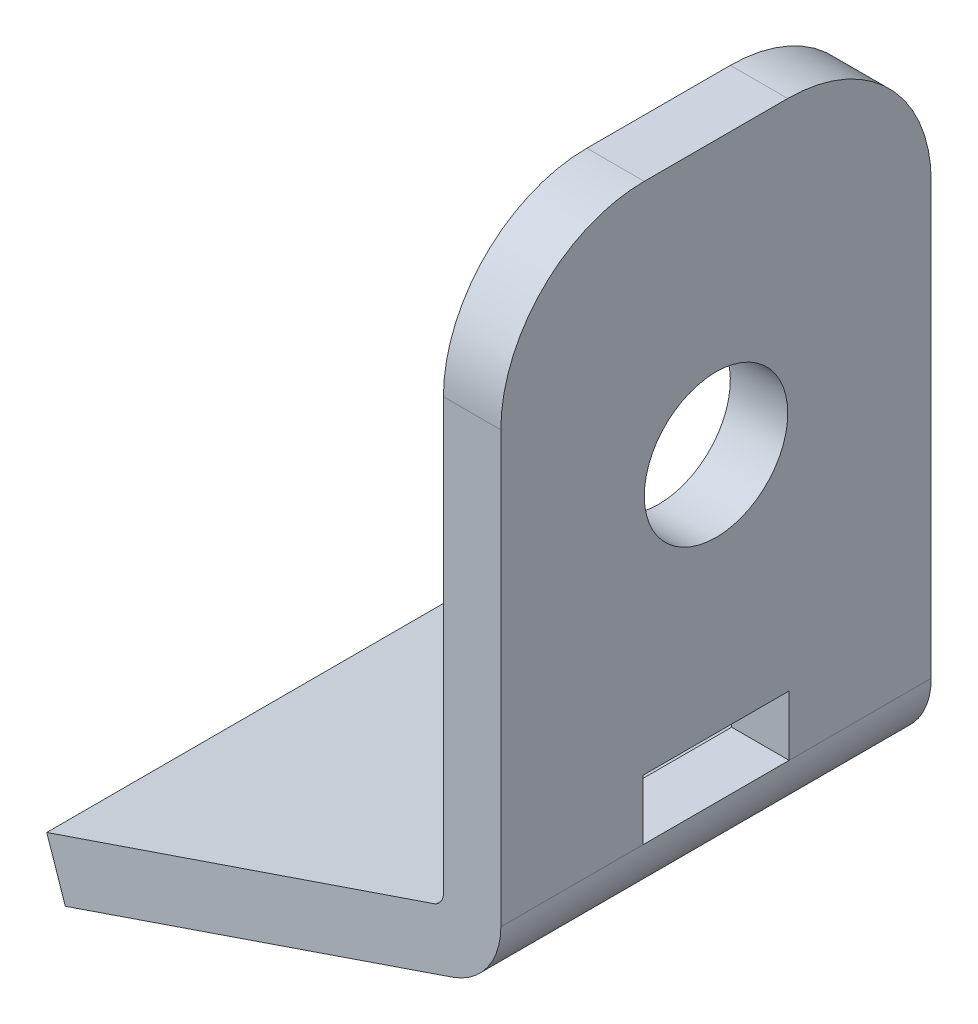
ISO-10303-21;
HEADER;
FILE_DESCRIPTION(('STEP AP214'),'2;1');
FILE_NAME('part.step','',(''),(''),'','','');
FILE_SCHEMA(('AUTOMOTIVE_DESIGN { 1 0 10303 214 1 1 1 1 }'));
ENDSEC;
DATA;
#1=APPLICATION_CONTEXT('core data for automotive mechanical design processes');
#2=APPLICATION_PROTOCOL_DEFINITION('international standard','automotive_design',2000,#1);
#3=PRODUCT_CONTEXT('',#1,'mechanical');
#4=PRODUCT('Part','Part','',(#3));
#5=PRODUCT_RELATED_PRODUCT_CATEGORY('part','',(#4));
#6=PRODUCT_DEFINITION_FORMATION('','',#4);
#7=PRODUCT_DEFINITION_CONTEXT('part definition',#1,'design');
#8=PRODUCT_DEFINITION('design','',#6,#7);
#9=PRODUCT_DEFINITION_SHAPE('','',#8);
#10=(LENGTH_UNIT() NAMED_UNIT(*) SI_UNIT(.MILLI.,.METRE.));
#11=(NAMED_UNIT(*) PLANE_ANGLE_UNIT() SI_UNIT($,.RADIAN.));
#12=(NAMED_UNIT(*) SI_UNIT($,.STERADIAN.) SOLID_ANGLE_UNIT());
#13=UNCERTAINTY_MEASURE_WITH_UNIT(LENGTH_MEASURE(1.E-05),#10,'distance_accuracy_value','');
#14=(GEOMETRIC_REPRESENTATION_CONTEXT(3) GLOBAL_UNCERTAINTY_ASSIGNED_CONTEXT((#13)) GLOBAL_UNIT_ASSIGNED_CONTEXT((#10,
#11,#12)) REPRESENTATION_CONTEXT('',''));
#15=CARTESIAN_POINT('',(0.,0.,0.));
#16=DIRECTION('',(0.,0.,1.));
#17=DIRECTION('',(1.,0.,0.));
#18=AXIS2_PLACEMENT_3D('',#15,#16,#17);
#19=CARTESIAN_POINT('',(-9.99999999999997,-375.320100819107,15.));
#20=DIRECTION('',(1.,0.,0.));
#21=DIRECTION('',(0.,1.,0.));
#22=AXIS2_PLACEMENT_3D('',#19,#20,#21);
#23=PLANE('',#22);
#24=CARTESIAN_POINT('',(-9.99999999999997,-364.820100819107,7.5));
#25=DIRECTION('',(1.,0.,0.));
#26=DIRECTION('',(0.,-1.,0.));
#27=AXIS2_PLACEMENT_3D('',#24,#25,#26);
#28=CIRCLE('',#27,2.5);
#29=CARTESIAN_POINT('',(-9.99999999999997,-367.320100819107,7.5));
#30=VERTEX_POINT('',#29);
#31=EDGE_CURVE('E177',#30,#30,#28,.T.);
#32=ORIENTED_EDGE('',*,*,#31,.T.);
#33=EDGE_LOOP('',(#32));
#34=FACE_BOUND('',#33,.T.);
#35=DIRECTION('',(0.,1.,0.));
#36=VECTOR('',#35,1.);
#37=CARTESIAN_POINT('',(-9.99999999999997,-375.320100819107,0.));
#38=LINE('',#37,#36);
#39=CARTESIAN_POINT('',(-9.99999999999997,-375.320100819107,0.));
#40=VERTEX_POINT('',#39);
#41=CARTESIAN_POINT('',(-9.99999999999997,-360.320100819107,0.));
#42=VERTEX_POINT('',#41);
#43=EDGE_CURVE('E208',#40,#42,#38,.T.);
#44=ORIENTED_EDGE('',*,*,#43,.F.);
#45=DIRECTION('',(0.,0.,-1.));
#46=VECTOR('',#45,1.);
#47=CARTESIAN_POINT('',(-9.99999999999997,-375.320100819107,15.));
#48=LINE('',#47,#46);
#49=CARTESIAN_POINT('',(-9.99999999999997,-375.320100819107,4.95279767505963));
#50=VERTEX_POINT('',#49);
#51=EDGE_CURVE('E162',#50,#40,#48,.T.);
#52=ORIENTED_EDGE('',*,*,#51,.F.);
#53=DIRECTION('',(0.,1.,0.));
#54=VECTOR('',#53,1.);
#55=CARTESIAN_POINT('',(-9.99999999999997,-375.320100819107,4.95279767505963));
#56=LINE('',#55,#54);
#57=CARTESIAN_POINT('',(-9.99999999999997,-373.22351081855,4.95279767505963));
#58=VERTEX_POINT('',#57);
#59=EDGE_CURVE('E142',#50,#58,#56,.T.);
#60=ORIENTED_EDGE('',*,*,#59,.T.);
#61=DIRECTION('',(0.,0.,-1.));
#62=VECTOR('',#61,1.);
#63=CARTESIAN_POINT('',(-9.99999999999997,-373.22351081855,10.0482237433539));
#64=LINE('',#63,#62);
#65=CARTESIAN_POINT('',(-9.99999999999997,-373.22351081855,10.0482237433539));
#66=VERTEX_POINT('',#65);
#67=EDGE_CURVE('E153',#66,#58,#64,.T.);
#68=ORIENTED_EDGE('',*,*,#67,.F.);
#69=DIRECTION('',(0.,1.,0.));
#70=VECTOR('',#69,1.);
#71=CARTESIAN_POINT('',(-9.99999999999997,-375.320100819107,10.0482237433539));
#72=LINE('',#71,#70);
#73=CARTESIAN_POINT('',(-9.99999999999997,-375.320100819107,10.0482237433539));
#74=VERTEX_POINT('',#73);
#75=EDGE_CURVE('E158',#74,#66,#72,.T.);
#76=ORIENTED_EDGE('',*,*,#75,.F.);
#77=CARTESIAN_POINT('',(-9.99999999999997,-375.320100819107,15.));
#78=VERTEX_POINT('',#77);
#79=EDGE_CURVE('E228',#78,#74,#48,.T.);
#80=ORIENTED_EDGE('',*,*,#79,.F.);
#81=DIRECTION('',(0.,1.,0.));
#82=VECTOR('',#81,1.);
#83=CARTESIAN_POINT('',(-9.99999999999997,-375.320100819107,15.));
#84=LINE('',#83,#82);
#85=CARTESIAN_POINT('',(-9.99999999999997,-360.320100819107,15.));
#86=VERTEX_POINT('',#85);
#87=EDGE_CURVE('E191',#78,#86,#84,.T.);
#88=ORIENTED_EDGE('',*,*,#87,.T.);
#89=CARTESIAN_POINT('',(-9.99999999999997,-360.320100819107,10.));
#90=DIRECTION('',(-1.,0.,0.));
#91=DIRECTION('',(0.,1.,0.));
#92=AXIS2_PLACEMENT_3D('',#89,#90,#91);
#93=CIRCLE('',#92,5.);
#94=CARTESIAN_POINT('',(-9.99999999999997,-355.320100819107,10.));
#95=VERTEX_POINT('',#94);
#96=EDGE_CURVE('E246',#95,#86,#93,.F.);
#97=ORIENTED_EDGE('',*,*,#96,.F.);
#98=DIRECTION('',(0.,0.,-1.));
#99=VECTOR('',#98,1.);
#100=CARTESIAN_POINT('',(-9.99999999999997,-355.320100819107,15.));
#101=LINE('',#100,#99);
#102=CARTESIAN_POINT('',(-9.99999999999997,-355.320100819107,5.));
#103=VERTEX_POINT('',#102);
#104=EDGE_CURVE('E225',#95,#103,#101,.T.);
#105=ORIENTED_EDGE('',*,*,#104,.T.);
#106=CARTESIAN_POINT('',(-9.99999999999997,-360.320100819107,5.));
#107=DIRECTION('',(-1.,0.,0.));
#108=DIRECTION('',(0.,1.,0.));
#109=AXIS2_PLACEMENT_3D('',#106,#107,#108);
#110=CIRCLE('',#109,5.);
#111=EDGE_CURVE('E248',#42,#103,#110,.F.);
#112=ORIENTED_EDGE('',*,*,#111,.F.);
#113=EDGE_LOOP('',(#44,#52,#60,#68,#76,#80,#88,#97,#105,#112));
#114=FACE_BOUND('',#113,.T.);
#115=ADVANCED_FACE('F37',(#34,#114),#23,.F.);
#116=CARTESIAN_POINT('',(-7.99778991779578,-375.320100819107,15.));
#117=DIRECTION('',(0.999999993894421,0.000110504109535088,0.));
#118=DIRECTION('',(-0.000110504109535088,0.999999993894421,0.));
#119=AXIS2_PLACEMENT_3D('',#116,#117,#118);
#120=PLANE('',#119);
#121=CARTESIAN_POINT('',(-7.99895021095298,-364.820100819107,7.5));
#122=DIRECTION('',(-0.999999993894421,-0.000110504109535088,0.));
#123=DIRECTION('',(-0.000110504109535088,0.999999993894421,0.));
#124=AXIS2_PLACEMENT_3D('',#121,#122,#123);
#125=ELLIPSE('',#124,2.50000001526395,2.5);
#126=CARTESIAN_POINT('',(-7.9992264712285,-362.320100819107,7.5));
#127=VERTEX_POINT('',#126);
#128=EDGE_CURVE('E180',#127,#127,#125,.T.);
#129=ORIENTED_EDGE('',*,*,#128,.T.);
#130=EDGE_LOOP('',(#129));
#131=FACE_BOUND('',#130,.T.);
#132=DIRECTION('',(0.,0.,-1.));
#133=VECTOR('',#132,1.);
#134=CARTESIAN_POINT('',(-7.99999999999997,-355.320100819107,15.));
#135=LINE('',#134,#133);
#136=CARTESIAN_POINT('',(-7.99999999999997,-355.320100819107,10.));
#137=VERTEX_POINT('',#136);
#138=CARTESIAN_POINT('',(-7.99999999999997,-355.320100819107,5.));
#139=VERTEX_POINT('',#138);
#140=EDGE_CURVE('E221',#137,#139,#135,.T.);
#141=ORIENTED_EDGE('',*,*,#140,.F.);
#142=CARTESIAN_POINT('',(-7.99944747944892,-360.320100819107,10.));
#143=DIRECTION('',(-0.999999993894421,-0.000110504109535088,0.));
#144=DIRECTION('',(0.000110504109535088,-0.999999993894421,0.));
#145=AXIS2_PLACEMENT_3D('',#142,#143,#144);
#146=ELLIPSE('',#145,5.0000000305279,5.);
#147=CARTESIAN_POINT('',(-7.99944747944892,-360.320100819107,15.));
#148=VERTEX_POINT('',#147);
#149=EDGE_CURVE('E253',#148,#137,#146,.T.);
#150=ORIENTED_EDGE('',*,*,#149,.F.);
#151=DIRECTION('',(-0.000110504109535088,0.999999993894421,0.));
#152=VECTOR('',#151,1.);
#153=CARTESIAN_POINT('',(-7.99778991779578,-375.320100819107,15.));
#154=LINE('',#153,#152);
#155=CARTESIAN_POINT('',(-7.9977899177958,-375.320100819107,15.));
#156=VERTEX_POINT('',#155);
#157=EDGE_CURVE('E194',#156,#148,#154,.T.);
#158=ORIENTED_EDGE('',*,*,#157,.F.);
#159=DIRECTION('',(0.,0.,-1.));
#160=VECTOR('',#159,1.);
#161=CARTESIAN_POINT('',(-7.9977899177958,-375.320100819107,15.));
#162=LINE('',#161,#160);
#163=CARTESIAN_POINT('',(-7.9977899177958,-375.320100819107,10.0482237433539));
#164=VERTEX_POINT('',#163);
#165=EDGE_CURVE('E218',#156,#164,#162,.T.);
#166=ORIENTED_EDGE('',*,*,#165,.T.);
#167=DIRECTION('',(0.000110504109535088,-0.999999993894421,0.));
#168=VECTOR('',#167,1.);
#169=CARTESIAN_POINT('',(-7.99778991779578,-375.320100819107,10.0482237433539));
#170=LINE('',#169,#168);
#171=CARTESIAN_POINT('',(-7.99802159960826,-373.22351081855,10.0482237433539));
#172=VERTEX_POINT('',#171);
#173=EDGE_CURVE('E174',#172,#164,#170,.T.);
#174=ORIENTED_EDGE('',*,*,#173,.F.);
#175=DIRECTION('',(0.,0.,1.));
#176=VECTOR('',#175,1.);
#177=CARTESIAN_POINT('',(-7.99802159960826,-373.22351081855,15.));
#178=LINE('',#177,#176);
#179=CARTESIAN_POINT('',(-7.99802159960826,-373.22351081855,4.95279767505963));
#180=VERTEX_POINT('',#179);
#181=EDGE_CURVE('E240',#180,#172,#178,.T.);
#182=ORIENTED_EDGE('',*,*,#181,.F.);
#183=DIRECTION('',(0.000110504109535088,-0.999999993894421,0.));
#184=VECTOR('',#183,1.);
#185=CARTESIAN_POINT('',(-7.99778991779578,-375.320100819107,4.95279767505963));
#186=LINE('',#185,#184);
#187=CARTESIAN_POINT('',(-7.9977899177958,-375.320100819107,4.95279767505963));
#188=VERTEX_POINT('',#187);
#189=EDGE_CURVE('E145',#180,#188,#186,.T.);
#190=ORIENTED_EDGE('',*,*,#189,.T.);
#191=CARTESIAN_POINT('',(-7.9977899177958,-375.320100819107,0.));
#192=VERTEX_POINT('',#191);
#193=EDGE_CURVE('E217',#188,#192,#162,.T.);
#194=ORIENTED_EDGE('',*,*,#193,.T.);
#195=DIRECTION('',(-0.000110504109535088,0.999999993894421,0.));
#196=VECTOR('',#195,1.);
#197=CARTESIAN_POINT('',(-7.99778991779578,-375.320100819107,0.));
#198=LINE('',#197,#196);
#199=CARTESIAN_POINT('',(-7.99944747944892,-360.320100819107,0.));
#200=VERTEX_POINT('',#199);
#201=EDGE_CURVE('E211',#192,#200,#198,.T.);
#202=ORIENTED_EDGE('',*,*,#201,.T.);
#203=CARTESIAN_POINT('',(-7.99944747944892,-360.320100819107,5.));
#204=DIRECTION('',(-0.999999993894421,-0.000110504109535088,0.));
#205=DIRECTION('',(-0.000110504109535088,0.999999993894421,0.));
#206=AXIS2_PLACEMENT_3D('',#203,#204,#205);
#207=ELLIPSE('',#206,5.0000000305279,5.);
#208=EDGE_CURVE('E45',#139,#200,#207,.T.);
#209=ORIENTED_EDGE('',*,*,#208,.F.);
#210=EDGE_LOOP('',(#141,#150,#158,#166,#174,#182,#190,#194,#202,#209));
#211=FACE_BOUND('',#210,.T.);
#212=ADVANCED_FACE('F260',(#131,#211),#120,.T.);
#213=CARTESIAN_POINT('',(-9.64273955948167,-377.669332371071,15.));
#214=DIRECTION('',(-0.323043540097111,0.946384103417596,0.));
#215=DIRECTION('',(-0.946384103417596,-0.323043540097111,0.));
#216=AXIS2_PLACEMENT_3D('',#213,#214,#215);
#217=PLANE('',#216);
#218=DIRECTION('',(-0.946384103417596,-0.323043540097111,0.));
#219=VECTOR('',#218,1.);
#220=CARTESIAN_POINT('',(-9.64273955948167,-377.669332371071,0.));
#221=LINE('',#220,#219);
#222=CARTESIAN_POINT('',(-9.64273955948167,-377.669332371071,0.));
#223=VERTEX_POINT('',#222);
#224=CARTESIAN_POINT('',(-23.1754299757358,-382.28864941509,0.));
#225=VERTEX_POINT('',#224);
#226=EDGE_CURVE('E199',#223,#225,#221,.T.);
#227=ORIENTED_EDGE('',*,*,#226,.F.);
#228=DIRECTION('',(0.,0.,-1.));
#229=VECTOR('',#228,1.);
#230=CARTESIAN_POINT('',(-9.64273955948167,-377.669332371071,15.));
#231=LINE('',#230,#229);
#232=CARTESIAN_POINT('',(-9.64273955948167,-377.669332371071,15.));
#233=VERTEX_POINT('',#232);
#234=EDGE_CURVE('E198',#233,#223,#231,.T.);
#235=ORIENTED_EDGE('',*,*,#234,.F.);
#236=DIRECTION('',(-0.946384103417596,-0.323043540097111,0.));
#237=VECTOR('',#236,1.);
#238=CARTESIAN_POINT('',(-9.64273955948167,-377.669332371071,15.));
#239=LINE('',#238,#237);
#240=CARTESIAN_POINT('',(-23.1754299757358,-382.28864941509,15.));
#241=VERTEX_POINT('',#240);
#242=EDGE_CURVE('E181',#233,#241,#239,.T.);
#243=ORIENTED_EDGE('',*,*,#242,.T.);
#244=DIRECTION('',(0.,0.,-1.));
#245=VECTOR('',#244,1.);
#246=CARTESIAN_POINT('',(-23.1754299757358,-382.28864941509,15.));
#247=LINE('',#246,#245);
#248=EDGE_CURVE('E237',#241,#225,#247,.T.);
#249=ORIENTED_EDGE('',*,*,#248,.T.);
#250=EDGE_LOOP('',(#227,#235,#243,#249));
#251=FACE_BOUND('',#250,.T.);
#252=ADVANCED_FACE('F302',(#251),#217,.F.);
#253=CARTESIAN_POINT('',(-23.8241382022311,-380.384479307007,15.));
#254=DIRECTION('',(-0.946577072562311,-0.322477666977677,0.));
#255=DIRECTION('',(0.322477666977677,-0.946577072562311,0.));
#256=AXIS2_PLACEMENT_3D('',#253,#254,#255);
#257=PLANE('',#256);
#258=DIRECTION('',(0.322477666977677,-0.946577072562311,0.));
#259=VECTOR('',#258,1.);
#260=CARTESIAN_POINT('',(-23.8241382022311,-380.384479307007,0.));
#261=LINE('',#260,#259);
#262=CARTESIAN_POINT('',(-23.8241382022311,-380.384479307007,0.));
#263=VERTEX_POINT('',#262);
#264=EDGE_CURVE('E202',#263,#225,#261,.T.);
#265=ORIENTED_EDGE('',*,*,#264,.T.);
#266=ORIENTED_EDGE('',*,*,#248,.F.);
#267=DIRECTION('',(0.322477666977677,-0.946577072562311,0.));
#268=VECTOR('',#267,1.);
#269=CARTESIAN_POINT('',(-23.8241382022311,-380.384479307007,15.));
#270=LINE('',#269,#268);
#271=CARTESIAN_POINT('',(-23.8241382022311,-380.384479307007,15.));
#272=VERTEX_POINT('',#271);
#273=EDGE_CURVE('E184',#272,#241,#270,.T.);
#274=ORIENTED_EDGE('',*,*,#273,.F.);
#275=DIRECTION('',(0.,0.,-1.));
#276=VECTOR('',#275,1.);
#277=CARTESIAN_POINT('',(-23.8241382022311,-380.384479307007,15.));
#278=LINE('',#277,#276);
#279=EDGE_CURVE('E234',#272,#263,#278,.T.);
#280=ORIENTED_EDGE('',*,*,#279,.T.);
#281=EDGE_LOOP('',(#265,#266,#274,#280));
#282=FACE_BOUND('',#281,.T.);
#283=ADVANCED_FACE('F298',(#282),#257,.T.);
#284=CARTESIAN_POINT('',(-10.2886908691296,-375.773254712625,15.));
#285=DIRECTION('',(-0.322477666977678,0.94657707256231,0.));
#286=DIRECTION('',(-0.946577072562311,-0.322477666977678,0.));
#287=AXIS2_PLACEMENT_3D('',#284,#285,#286);
#288=PLANE('',#287);
#289=DIRECTION('',(-0.94657707256231,-0.322477666977678,0.));
#290=VECTOR('',#289,1.);
#291=CARTESIAN_POINT('',(-10.2886908691296,-375.773254712625,0.));
#292=LINE('',#291,#290);
#293=CARTESIAN_POINT('',(-10.2886908691296,-375.773254712625,0.));
#294=VERTEX_POINT('',#293);
#295=EDGE_CURVE('E204',#294,#263,#292,.T.);
#296=ORIENTED_EDGE('',*,*,#295,.T.);
#297=ORIENTED_EDGE('',*,*,#279,.F.);
#298=DIRECTION('',(-0.946577072562312,-0.322477666977673,0.));
#299=VECTOR('',#298,1.);
#300=CARTESIAN_POINT('',(-21.4549551044454,-379.577351540909,15.));
#301=LINE('',#300,#299);
#302=CARTESIAN_POINT('',(-10.2886908691296,-375.773254712625,15.));
#303=VERTEX_POINT('',#302);
#304=EDGE_CURVE('E187',#303,#272,#301,.T.);
#305=ORIENTED_EDGE('',*,*,#304,.F.);
#306=DIRECTION('',(0.,0.,-1.));
#307=VECTOR('',#306,1.);
#308=CARTESIAN_POINT('',(-10.2886908691296,-375.773254712625,15.));
#309=LINE('',#308,#307);
#310=EDGE_CURVE('E231',#303,#294,#309,.T.);
#311=ORIENTED_EDGE('',*,*,#310,.T.);
#312=EDGE_LOOP('',(#296,#297,#305,#311));
#313=FACE_BOUND('',#312,.T.);
#314=ADVANCED_FACE('F294',(#313),#288,.T.);
#315=CARTESIAN_POINT('',(-10.5,-375.320100819107,15.));
#316=DIRECTION('',(0.,0.,-1.));
#317=DIRECTION('',(1.,0.,0.));
#318=AXIS2_PLACEMENT_3D('',#315,#316,#317);
#319=CYLINDRICAL_SURFACE('',#318,0.500000000000024);
#320=CARTESIAN_POINT('',(-10.5,-375.320100819107,0.));
#321=DIRECTION('',(0.,0.,1.));
#322=DIRECTION('',(1.,0.,0.));
#323=AXIS2_PLACEMENT_3D('',#320,#321,#322);
#324=CIRCLE('',#323,0.500000000000024);
#325=EDGE_CURVE('E206',#294,#40,#324,.T.);
#326=ORIENTED_EDGE('',*,*,#325,.F.);
#327=ORIENTED_EDGE('',*,*,#310,.F.);
#328=CARTESIAN_POINT('',(-10.5,-375.320100819107,15.));
#329=DIRECTION('',(0.,0.,1.));
#330=DIRECTION('',(1.,0.,0.));
#331=AXIS2_PLACEMENT_3D('',#328,#329,#330);
#332=CIRCLE('',#331,0.500000000000024);
#333=EDGE_CURVE('E189',#303,#78,#332,.T.);
#334=ORIENTED_EDGE('',*,*,#333,.T.);
#335=ORIENTED_EDGE('',*,*,#79,.T.);
#336=DIRECTION('',(0.,0.,-1.));
#337=VECTOR('',#336,1.);
#338=CARTESIAN_POINT('',(-9.99999999999997,-375.320100819107,10.0482237433539));
#339=LINE('',#338,#337);
#340=EDGE_CURVE('E163',#74,#50,#339,.T.);
#341=ORIENTED_EDGE('',*,*,#340,.T.);
#342=ORIENTED_EDGE('',*,*,#51,.T.);
#343=EDGE_LOOP('',(#326,#327,#334,#335,#341,#342));
#344=FACE_BOUND('',#343,.T.);
#345=ADVANCED_FACE('F290',(#344),#319,.F.);
#346=CARTESIAN_POINT('',(-7.99999999999997,-355.320100819107,15.));
#347=DIRECTION('',(0.,1.,0.));
#348=DIRECTION('',(0.,0.,-1.));
#349=AXIS2_PLACEMENT_3D('',#346,#347,#348);
#350=PLANE('',#349);
#351=ORIENTED_EDGE('',*,*,#104,.F.);
#352=DIRECTION('',(-1.,0.,0.));
#353=VECTOR('',#352,1.);
#354=CARTESIAN_POINT('',(-9.99999999999997,-355.320100819107,10.));
#355=LINE('',#354,#353);
#356=EDGE_CURVE('E250',#137,#95,#355,.T.);
#357=ORIENTED_EDGE('',*,*,#356,.F.);
#358=ORIENTED_EDGE('',*,*,#140,.T.);
#359=DIRECTION('',(-1.,0.,0.));
#360=VECTOR('',#359,1.);
#361=CARTESIAN_POINT('',(-7.99999999999997,-355.320100819107,5.));
#362=LINE('',#361,#360);
#363=EDGE_CURVE('E58',#103,#139,#362,.F.);
#364=ORIENTED_EDGE('',*,*,#363,.F.);
#365=EDGE_LOOP('',(#351,#357,#358,#364));
#366=FACE_BOUND('',#365,.T.);
#367=ADVANCED_FACE('F268',(#366),#350,.T.);
#368=CARTESIAN_POINT('',(-10.4977899177958,-375.320100819107,15.));
#369=DIRECTION('',(0.,0.,-1.));
#370=DIRECTION('',(1.,0.,0.));
#371=AXIS2_PLACEMENT_3D('',#368,#369,#370);
#372=CYLINDRICAL_SURFACE('',#371,2.50000000000001);
#373=CARTESIAN_POINT('',(-10.4977899177958,-375.320100819107,0.));
#374=DIRECTION('',(0.,0.,1.));
#375=DIRECTION('',(1.,0.,0.));
#376=AXIS2_PLACEMENT_3D('',#373,#374,#375);
#377=CIRCLE('',#376,2.50000000000001);
#378=EDGE_CURVE('E185',#223,#192,#377,.T.);
#379=ORIENTED_EDGE('',*,*,#378,.T.);
#380=ORIENTED_EDGE('',*,*,#193,.F.);
#381=EDGE_CURVE('E222',#164,#188,#162,.T.);
#382=ORIENTED_EDGE('',*,*,#381,.F.);
#383=ORIENTED_EDGE('',*,*,#165,.F.);
#384=CARTESIAN_POINT('',(-10.4977899177958,-375.320100819107,15.));
#385=DIRECTION('',(0.,0.,1.));
#386=DIRECTION('',(1.,0.,0.));
#387=AXIS2_PLACEMENT_3D('',#384,#385,#386);
#388=CIRCLE('',#387,2.50000000000001);
#389=EDGE_CURVE('E196',#233,#156,#388,.T.);
#390=ORIENTED_EDGE('',*,*,#389,.F.);
#391=ORIENTED_EDGE('',*,*,#234,.T.);
#392=EDGE_LOOP('',(#379,#380,#382,#383,#390,#391));
#393=FACE_BOUND('',#392,.T.);
#394=ADVANCED_FACE('F281',(#393),#372,.T.);
#395=CARTESIAN_POINT('',(-10.5,-375.320100819107,15.));
#396=DIRECTION('',(0.,0.,-1.));
#397=DIRECTION('',(1.,0.,0.));
#398=AXIS2_PLACEMENT_3D('',#395,#396,#397);
#399=PLANE('',#398);
#400=ORIENTED_EDGE('',*,*,#87,.F.);
#401=ORIENTED_EDGE('',*,*,#333,.F.);
#402=ORIENTED_EDGE('',*,*,#304,.T.);
#403=ORIENTED_EDGE('',*,*,#273,.T.);
#404=ORIENTED_EDGE('',*,*,#242,.F.);
#405=ORIENTED_EDGE('',*,*,#389,.T.);
#406=ORIENTED_EDGE('',*,*,#157,.T.);
#407=DIRECTION('',(-1.,0.,0.));
#408=VECTOR('',#407,1.);
#409=CARTESIAN_POINT('',(-7.99999999999997,-360.320100819107,15.));
#410=LINE('',#409,#408);
#411=EDGE_CURVE('E11',#86,#148,#410,.F.);
#412=ORIENTED_EDGE('',*,*,#411,.F.);
#413=EDGE_LOOP('',(#400,#401,#402,#403,#404,#405,#406,#412));
#414=FACE_BOUND('',#413,.T.);
#415=ADVANCED_FACE('F274',(#414),#399,.F.);
#416=CARTESIAN_POINT('',(-10.5,-375.320100819107,0.));
#417=DIRECTION('',(0.,0.,-1.));
#418=DIRECTION('',(1.,0.,0.));
#419=AXIS2_PLACEMENT_3D('',#416,#417,#418);
#420=PLANE('',#419);
#421=ORIENTED_EDGE('',*,*,#201,.F.);
#422=ORIENTED_EDGE('',*,*,#378,.F.);
#423=ORIENTED_EDGE('',*,*,#226,.T.);
#424=ORIENTED_EDGE('',*,*,#264,.F.);
#425=ORIENTED_EDGE('',*,*,#295,.F.);
#426=ORIENTED_EDGE('',*,*,#325,.T.);
#427=ORIENTED_EDGE('',*,*,#43,.T.);
#428=DIRECTION('',(-1.,0.,0.));
#429=VECTOR('',#428,1.);
#430=CARTESIAN_POINT('',(-10.5,-360.320100819107,0.));
#431=LINE('',#430,#429);
#432=EDGE_CURVE('E244',#200,#42,#431,.T.);
#433=ORIENTED_EDGE('',*,*,#432,.F.);
#434=EDGE_LOOP('',(#421,#422,#423,#424,#425,#426,#427,#433));
#435=FACE_BOUND('',#434,.T.);
#436=ADVANCED_FACE('F263',(#435),#420,.T.);
#437=CARTESIAN_POINT('',(5.00000000000003,-364.820100819107,7.5));
#438=DIRECTION('',(-1.,0.,0.));
#439=DIRECTION('',(0.,-1.,0.));
#440=AXIS2_PLACEMENT_3D('',#437,#438,#439);
#441=CYLINDRICAL_SURFACE('',#440,2.5);
#442=ORIENTED_EDGE('',*,*,#128,.F.);
#443=EDGE_LOOP('',(#442));
#444=FACE_BOUND('',#443,.T.);
#445=ORIENTED_EDGE('',*,*,#31,.F.);
#446=EDGE_LOOP('',(#445));
#447=FACE_BOUND('',#446,.T.);
#448=ADVANCED_FACE('F353',(#444,#447),#441,.F.);
#449=CARTESIAN_POINT('',(5.00000000000003,-375.320100819107,10.0482237433539));
#450=DIRECTION('',(0.,-1.,0.));
#451=DIRECTION('',(1.,0.,0.));
#452=AXIS2_PLACEMENT_3D('',#449,#450,#451);
#453=PLANE('',#452);
#454=ORIENTED_EDGE('',*,*,#381,.T.);
#455=DIRECTION('',(-1.,0.,0.));
#456=VECTOR('',#455,1.);
#457=CARTESIAN_POINT('',(5.00000000000003,-375.320100819107,4.95279767505963));
#458=LINE('',#457,#456);
#459=EDGE_CURVE('E150',#188,#50,#458,.T.);
#460=ORIENTED_EDGE('',*,*,#459,.T.);
#461=ORIENTED_EDGE('',*,*,#340,.F.);
#462=DIRECTION('',(-1.,0.,0.));
#463=VECTOR('',#462,1.);
#464=CARTESIAN_POINT('',(5.00000000000003,-375.320100819107,10.0482237433539));
#465=LINE('',#464,#463);
#466=EDGE_CURVE('E169',#164,#74,#465,.T.);
#467=ORIENTED_EDGE('',*,*,#466,.F.);
#468=EDGE_LOOP('',(#454,#460,#461,#467));
#469=FACE_BOUND('',#468,.T.);
#470=ADVANCED_FACE('F288',(#469),#453,.F.);
#471=CARTESIAN_POINT('',(5.00000000000003,-375.320100819107,10.0482237433539));
#472=DIRECTION('',(0.,0.,-1.));
#473=DIRECTION('',(1.,0.,0.));
#474=AXIS2_PLACEMENT_3D('',#471,#472,#473);
#475=PLANE('',#474);
#476=DIRECTION('',(-1.,0.,0.));
#477=VECTOR('',#476,1.);
#478=CARTESIAN_POINT('',(5.00000000000003,-373.22351081855,10.0482237433539));
#479=LINE('',#478,#477);
#480=EDGE_CURVE('E149',#172,#66,#479,.T.);
#481=ORIENTED_EDGE('',*,*,#480,.F.);
#482=ORIENTED_EDGE('',*,*,#173,.T.);
#483=ORIENTED_EDGE('',*,*,#466,.T.);
#484=ORIENTED_EDGE('',*,*,#75,.T.);
#485=EDGE_LOOP('',(#481,#482,#483,#484));
#486=FACE_BOUND('',#485,.T.);
#487=ADVANCED_FACE('F285',(#486),#475,.T.);
#488=CARTESIAN_POINT('',(5.00000000000003,-373.22351081855,10.0482237433539));
#489=DIRECTION('',(0.,-1.,0.));
#490=DIRECTION('',(1.,0.,0.));
#491=AXIS2_PLACEMENT_3D('',#488,#489,#490);
#492=PLANE('',#491);
#493=DIRECTION('',(-1.,0.,0.));
#494=VECTOR('',#493,1.);
#495=CARTESIAN_POINT('',(5.00000000000003,-373.22351081855,4.95279767505963));
#496=LINE('',#495,#494);
#497=EDGE_CURVE('E138',#180,#58,#496,.T.);
#498=ORIENTED_EDGE('',*,*,#497,.F.);
#499=ORIENTED_EDGE('',*,*,#181,.T.);
#500=ORIENTED_EDGE('',*,*,#480,.T.);
#501=ORIENTED_EDGE('',*,*,#67,.T.);
#502=EDGE_LOOP('',(#498,#499,#500,#501));
#503=FACE_BOUND('',#502,.T.);
#504=ADVANCED_FACE('F154',(#503),#492,.T.);
#505=CARTESIAN_POINT('',(5.00000000000003,-375.320100819107,4.95279767505963));
#506=DIRECTION('',(0.,0.,-1.));
#507=DIRECTION('',(1.,0.,0.));
#508=AXIS2_PLACEMENT_3D('',#505,#506,#507);
#509=PLANE('',#508);
#510=ORIENTED_EDGE('',*,*,#189,.F.);
#511=ORIENTED_EDGE('',*,*,#497,.T.);
#512=ORIENTED_EDGE('',*,*,#59,.F.);
#513=ORIENTED_EDGE('',*,*,#459,.F.);
#514=EDGE_LOOP('',(#510,#511,#512,#513));
#515=FACE_BOUND('',#514,.T.);
#516=ADVANCED_FACE('F140',(#515),#509,.F.);
#517=CARTESIAN_POINT('',(-10.5,-360.320100819107,5.));
#518=DIRECTION('',(-1.,0.,0.));
#519=DIRECTION('',(0.,0.,-1.));
#520=AXIS2_PLACEMENT_3D('',#517,#518,#519);
#521=CYLINDRICAL_SURFACE('',#520,5.);
#522=ORIENTED_EDGE('',*,*,#208,.T.);
#523=ORIENTED_EDGE('',*,*,#432,.T.);
#524=ORIENTED_EDGE('',*,*,#111,.T.);
#525=ORIENTED_EDGE('',*,*,#363,.T.);
#526=EDGE_LOOP('',(#522,#523,#524,#525));
#527=FACE_BOUND('',#526,.T.);
#528=ADVANCED_FACE('F254',(#527),#521,.T.);
#529=CARTESIAN_POINT('',(-7.99999999999997,-360.320100819107,10.));
#530=DIRECTION('',(1.,0.,0.));
#531=DIRECTION('',(0.,0.,1.));
#532=AXIS2_PLACEMENT_3D('',#529,#530,#531);
#533=CYLINDRICAL_SURFACE('',#532,5.);
#534=ORIENTED_EDGE('',*,*,#149,.T.);
#535=ORIENTED_EDGE('',*,*,#356,.T.);
#536=ORIENTED_EDGE('',*,*,#96,.T.);
#537=ORIENTED_EDGE('',*,*,#411,.T.);
#538=EDGE_LOOP('',(#534,#535,#536,#537));
#539=FACE_BOUND('',#538,.T.);
#540=ADVANCED_FACE('F39',(#539),#533,.T.);
#541=CLOSED_SHELL('',(#115,#212,#252,#283,#314,#345,#367,#394,#415,#436,#448,#470,#487,#504,
#516,#528,#540));
#542=MANIFOLD_SOLID_BREP('B2',#541);
#543=ADVANCED_BREP_SHAPE_REPRESENTATION('',(#18,#542),#14);
#544=SHAPE_DEFINITION_REPRESENTATION(#9,#543);
ENDSEC;
END-ISO-10303-21;
